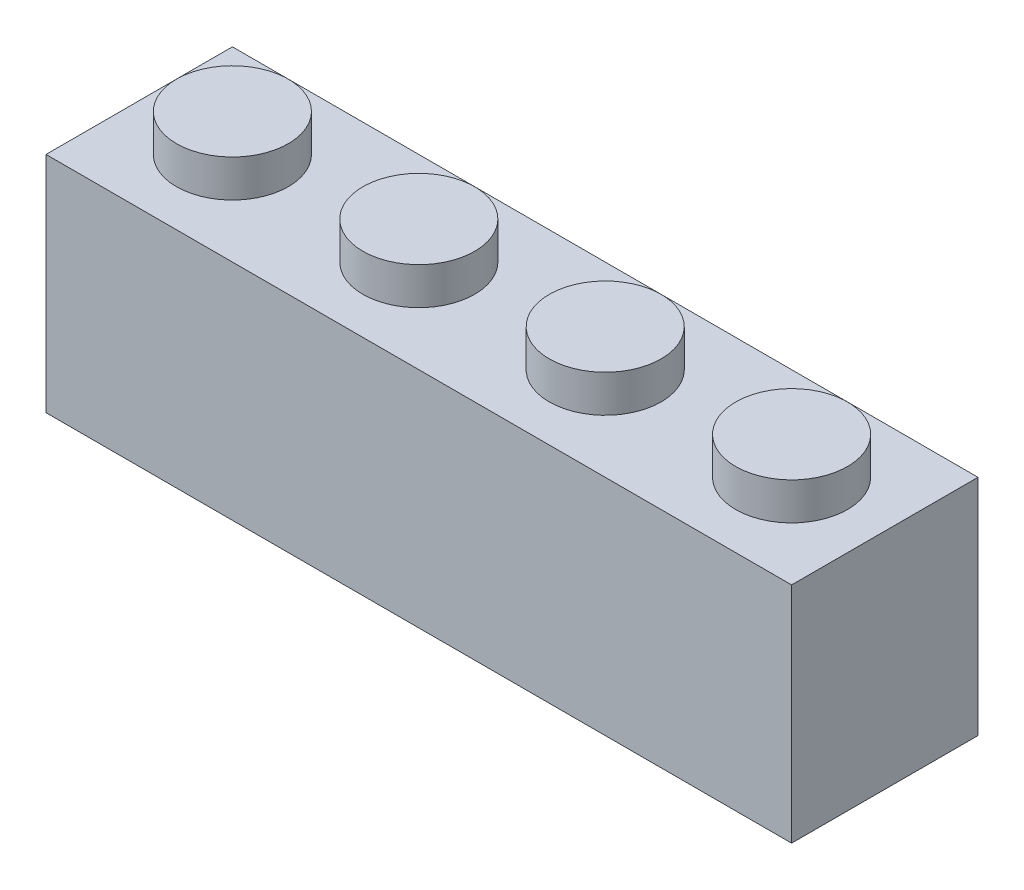
ISO-10303-21;
HEADER;
FILE_DESCRIPTION(('STEP AP214'),'2;1');
FILE_NAME('part.step','',(''),(''),'','','');
FILE_SCHEMA(('AUTOMOTIVE_DESIGN { 1 0 10303 214 1 1 1 1 }'));
ENDSEC;
DATA;
#1=APPLICATION_CONTEXT('core data for automotive mechanical design processes');
#2=APPLICATION_PROTOCOL_DEFINITION('international standard','automotive_design',2000,#1);
#3=PRODUCT_CONTEXT('',#1,'mechanical');
#4=PRODUCT('Part','Part','',(#3));
#5=PRODUCT_RELATED_PRODUCT_CATEGORY('part','',(#4));
#6=PRODUCT_DEFINITION_FORMATION('','',#4);
#7=PRODUCT_DEFINITION_CONTEXT('part definition',#1,'design');
#8=PRODUCT_DEFINITION('design','',#6,#7);
#9=PRODUCT_DEFINITION_SHAPE('','',#8);
#10=(LENGTH_UNIT() NAMED_UNIT(*) SI_UNIT(.MILLI.,.METRE.));
#11=(NAMED_UNIT(*) PLANE_ANGLE_UNIT() SI_UNIT($,.RADIAN.));
#12=(NAMED_UNIT(*) SI_UNIT($,.STERADIAN.) SOLID_ANGLE_UNIT());
#13=UNCERTAINTY_MEASURE_WITH_UNIT(LENGTH_MEASURE(1.E-05),#10,'distance_accuracy_value','');
#14=(GEOMETRIC_REPRESENTATION_CONTEXT(3) GLOBAL_UNCERTAINTY_ASSIGNED_CONTEXT((#13)) GLOBAL_UNIT_ASSIGNED_CONTEXT((#10,
#11,#12)) REPRESENTATION_CONTEXT('',''));
#15=CARTESIAN_POINT('',(0.,0.,0.));
#16=DIRECTION('',(0.,0.,1.));
#17=DIRECTION('',(1.,0.,0.));
#18=AXIS2_PLACEMENT_3D('',#15,#16,#17);
#19=CARTESIAN_POINT('',(-7.5,2.,0.));
#20=DIRECTION('',(0.,-1.,0.));
#21=DIRECTION('',(0.,0.,-1.));
#22=AXIS2_PLACEMENT_3D('',#19,#20,#21);
#23=CYLINDRICAL_SURFACE('',#22,1.5);
#24=CARTESIAN_POINT('',(-7.5,1.,0.));
#25=DIRECTION('',(0.,1.,0.));
#26=DIRECTION('',(0.,0.,1.));
#27=AXIS2_PLACEMENT_3D('',#24,#25,#26);
#28=CIRCLE('',#27,1.5);
#29=CARTESIAN_POINT('',(-7.5,1.,1.5));
#30=VERTEX_POINT('',#29);
#31=EDGE_CURVE('E83',#30,#30,#28,.T.);
#32=ORIENTED_EDGE('',*,*,#31,.T.);
#33=EDGE_LOOP('',(#32));
#34=FACE_BOUND('',#33,.T.);
#35=CARTESIAN_POINT('',(-7.5,2.,0.));
#36=DIRECTION('',(0.,1.,0.));
#37=DIRECTION('',(0.,0.,1.));
#38=AXIS2_PLACEMENT_3D('',#35,#36,#37);
#39=CIRCLE('',#38,1.5);
#40=CARTESIAN_POINT('',(-7.5,2.,1.5));
#41=VERTEX_POINT('',#40);
#42=EDGE_CURVE('E12',#41,#41,#39,.T.);
#43=ORIENTED_EDGE('',*,*,#42,.F.);
#44=EDGE_LOOP('',(#43));
#45=FACE_BOUND('',#44,.T.);
#46=ADVANCED_FACE('F80',(#34,#45),#23,.T.);
#47=CARTESIAN_POINT('',(0.,2.,0.));
#48=DIRECTION('',(0.,1.,0.));
#49=DIRECTION('',(0.,0.,1.));
#50=AXIS2_PLACEMENT_3D('',#47,#48,#49);
#51=PLANE('',#50);
#52=ORIENTED_EDGE('',*,*,#42,.T.);
#53=EDGE_LOOP('',(#52));
#54=FACE_BOUND('',#53,.T.);
#55=ADVANCED_FACE('F293',(#54),#51,.T.);
#56=CARTESIAN_POINT('',(-10.,1.,2.5));
#57=DIRECTION('',(0.,0.,-1.));
#58=DIRECTION('',(-1.,0.,0.));
#59=AXIS2_PLACEMENT_3D('',#56,#57,#58);
#60=PLANE('',#59);
#61=DIRECTION('',(0.,-1.,0.));
#62=VECTOR('',#61,1.);
#63=CARTESIAN_POINT('',(-10.,1.,2.5));
#64=LINE('',#63,#62);
#65=CARTESIAN_POINT('',(-10.,1.,2.5));
#66=VERTEX_POINT('',#65);
#67=CARTESIAN_POINT('',(-10.,-5.,2.5));
#68=VERTEX_POINT('',#67);
#69=EDGE_CURVE('E251',#66,#68,#64,.T.);
#70=ORIENTED_EDGE('',*,*,#69,.T.);
#71=DIRECTION('',(1.,0.,0.));
#72=VECTOR('',#71,1.);
#73=CARTESIAN_POINT('',(0.,-5.,2.5));
#74=LINE('',#73,#72);
#75=CARTESIAN_POINT('',(10.,-5.,2.5));
#76=VERTEX_POINT('',#75);
#77=EDGE_CURVE('E178',#68,#76,#74,.T.);
#78=ORIENTED_EDGE('',*,*,#77,.T.);
#79=DIRECTION('',(0.,-1.,0.));
#80=VECTOR('',#79,1.);
#81=CARTESIAN_POINT('',(10.,1.,2.5));
#82=LINE('',#81,#80);
#83=CARTESIAN_POINT('',(10.,1.,2.5));
#84=VERTEX_POINT('',#83);
#85=EDGE_CURVE('E257',#84,#76,#82,.T.);
#86=ORIENTED_EDGE('',*,*,#85,.F.);
#87=DIRECTION('',(1.,0.,0.));
#88=VECTOR('',#87,1.);
#89=CARTESIAN_POINT('',(-10.,1.,2.5));
#90=LINE('',#89,#88);
#91=EDGE_CURVE('E240',#66,#84,#90,.T.);
#92=ORIENTED_EDGE('',*,*,#91,.F.);
#93=EDGE_LOOP('',(#70,#78,#86,#92));
#94=FACE_BOUND('',#93,.T.);
#95=ADVANCED_FACE('F278',(#94),#60,.F.);
#96=CARTESIAN_POINT('',(10.,1.,2.5));
#97=DIRECTION('',(-1.,0.,0.));
#98=DIRECTION('',(0.,0.,1.));
#99=AXIS2_PLACEMENT_3D('',#96,#97,#98);
#100=PLANE('',#99);
#101=ORIENTED_EDGE('',*,*,#85,.T.);
#102=DIRECTION('',(0.,0.,-1.));
#103=VECTOR('',#102,1.);
#104=CARTESIAN_POINT('',(10.,-5.,0.));
#105=LINE('',#104,#103);
#106=CARTESIAN_POINT('',(10.,-5.,-2.5));
#107=VERTEX_POINT('',#106);
#108=EDGE_CURVE('E181',#76,#107,#105,.T.);
#109=ORIENTED_EDGE('',*,*,#108,.T.);
#110=DIRECTION('',(0.,-1.,0.));
#111=VECTOR('',#110,1.);
#112=CARTESIAN_POINT('',(10.,1.,-2.5));
#113=LINE('',#112,#111);
#114=CARTESIAN_POINT('',(10.,1.,-2.5));
#115=VERTEX_POINT('',#114);
#116=EDGE_CURVE('E255',#115,#107,#113,.T.);
#117=ORIENTED_EDGE('',*,*,#116,.F.);
#118=DIRECTION('',(0.,0.,-1.));
#119=VECTOR('',#118,1.);
#120=CARTESIAN_POINT('',(10.,1.,2.5));
#121=LINE('',#120,#119);
#122=EDGE_CURVE('E243',#84,#115,#121,.T.);
#123=ORIENTED_EDGE('',*,*,#122,.F.);
#124=EDGE_LOOP('',(#101,#109,#117,#123));
#125=FACE_BOUND('',#124,.T.);
#126=ADVANCED_FACE('F282',(#125),#100,.F.);
#127=CARTESIAN_POINT('',(-10.,1.,-2.5));
#128=DIRECTION('',(0.,0.,-1.));
#129=DIRECTION('',(-1.,0.,0.));
#130=AXIS2_PLACEMENT_3D('',#127,#128,#129);
#131=PLANE('',#130);
#132=ORIENTED_EDGE('',*,*,#116,.T.);
#133=DIRECTION('',(1.,0.,0.));
#134=VECTOR('',#133,1.);
#135=CARTESIAN_POINT('',(0.,-5.,-2.5));
#136=LINE('',#135,#134);
#137=CARTESIAN_POINT('',(-10.,-5.,-2.5));
#138=VERTEX_POINT('',#137);
#139=EDGE_CURVE('E184',#138,#107,#136,.T.);
#140=ORIENTED_EDGE('',*,*,#139,.F.);
#141=DIRECTION('',(0.,-1.,0.));
#142=VECTOR('',#141,1.);
#143=CARTESIAN_POINT('',(-10.,1.,-2.5));
#144=LINE('',#143,#142);
#145=CARTESIAN_POINT('',(-10.,1.,-2.5));
#146=VERTEX_POINT('',#145);
#147=EDGE_CURVE('E253',#146,#138,#144,.T.);
#148=ORIENTED_EDGE('',*,*,#147,.F.);
#149=DIRECTION('',(1.,0.,0.));
#150=VECTOR('',#149,1.);
#151=CARTESIAN_POINT('',(-10.,1.,-2.5));
#152=LINE('',#151,#150);
#153=EDGE_CURVE('E245',#146,#115,#152,.T.);
#154=ORIENTED_EDGE('',*,*,#153,.T.);
#155=EDGE_LOOP('',(#132,#140,#148,#154));
#156=FACE_BOUND('',#155,.T.);
#157=ADVANCED_FACE('F284',(#156),#131,.T.);
#158=CARTESIAN_POINT('',(-10.,1.,2.5));
#159=DIRECTION('',(-1.,0.,0.));
#160=DIRECTION('',(0.,0.,1.));
#161=AXIS2_PLACEMENT_3D('',#158,#159,#160);
#162=PLANE('',#161);
#163=ORIENTED_EDGE('',*,*,#147,.T.);
#164=DIRECTION('',(0.,0.,-1.));
#165=VECTOR('',#164,1.);
#166=CARTESIAN_POINT('',(-10.,-5.,0.));
#167=LINE('',#166,#165);
#168=EDGE_CURVE('E164',#68,#138,#167,.T.);
#169=ORIENTED_EDGE('',*,*,#168,.F.);
#170=ORIENTED_EDGE('',*,*,#69,.F.);
#171=DIRECTION('',(0.,0.,-1.));
#172=VECTOR('',#171,1.);
#173=CARTESIAN_POINT('',(-10.,1.,2.5));
#174=LINE('',#173,#172);
#175=EDGE_CURVE('E248',#66,#146,#174,.T.);
#176=ORIENTED_EDGE('',*,*,#175,.T.);
#177=EDGE_LOOP('',(#163,#169,#170,#176));
#178=FACE_BOUND('',#177,.T.);
#179=ADVANCED_FACE('F270',(#178),#162,.T.);
#180=CARTESIAN_POINT('',(0.,1.,0.));
#181=DIRECTION('',(0.,1.,0.));
#182=DIRECTION('',(0.,0.,1.));
#183=AXIS2_PLACEMENT_3D('',#180,#181,#182);
#184=PLANE('',#183);
#185=CARTESIAN_POINT('',(7.5,1.,0.));
#186=DIRECTION('',(0.,1.,0.));
#187=DIRECTION('',(0.,0.,1.));
#188=AXIS2_PLACEMENT_3D('',#185,#186,#187);
#189=CIRCLE('',#188,1.5);
#190=CARTESIAN_POINT('',(7.5,1.,1.5));
#191=VERTEX_POINT('',#190);
#192=EDGE_CURVE('E225',#191,#191,#189,.F.);
#193=ORIENTED_EDGE('',*,*,#192,.T.);
#194=EDGE_LOOP('',(#193));
#195=FACE_BOUND('',#194,.T.);
#196=CARTESIAN_POINT('',(2.5,1.,0.));
#197=DIRECTION('',(0.,1.,0.));
#198=DIRECTION('',(0.,0.,1.));
#199=AXIS2_PLACEMENT_3D('',#196,#197,#198);
#200=CIRCLE('',#199,1.5);
#201=CARTESIAN_POINT('',(2.5,1.,1.5));
#202=VERTEX_POINT('',#201);
#203=EDGE_CURVE('E231',#202,#202,#200,.F.);
#204=ORIENTED_EDGE('',*,*,#203,.T.);
#205=EDGE_LOOP('',(#204));
#206=FACE_BOUND('',#205,.T.);
#207=CARTESIAN_POINT('',(-2.5,1.,0.));
#208=DIRECTION('',(0.,1.,0.));
#209=DIRECTION('',(0.,0.,1.));
#210=AXIS2_PLACEMENT_3D('',#207,#208,#209);
#211=CIRCLE('',#210,1.5);
#212=CARTESIAN_POINT('',(-2.5,1.,1.5));
#213=VERTEX_POINT('',#212);
#214=EDGE_CURVE('E237',#213,#213,#211,.F.);
#215=ORIENTED_EDGE('',*,*,#214,.T.);
#216=EDGE_LOOP('',(#215));
#217=FACE_BOUND('',#216,.T.);
#218=ORIENTED_EDGE('',*,*,#31,.F.);
#219=EDGE_LOOP('',(#218));
#220=FACE_BOUND('',#219,.T.);
#221=ORIENTED_EDGE('',*,*,#91,.T.);
#222=ORIENTED_EDGE('',*,*,#122,.T.);
#223=ORIENTED_EDGE('',*,*,#153,.F.);
#224=ORIENTED_EDGE('',*,*,#175,.F.);
#225=EDGE_LOOP('',(#221,#222,#223,#224));
#226=FACE_BOUND('',#225,.T.);
#227=ADVANCED_FACE('F266',(#195,#206,#217,#220,#226),#184,.T.);
#228=CARTESIAN_POINT('',(-2.5,2.,0.));
#229=DIRECTION('',(0.,-1.,0.));
#230=DIRECTION('',(0.,0.,-1.));
#231=AXIS2_PLACEMENT_3D('',#228,#229,#230);
#232=CYLINDRICAL_SURFACE('',#231,1.5);
#233=ORIENTED_EDGE('',*,*,#214,.F.);
#234=EDGE_LOOP('',(#233));
#235=FACE_BOUND('',#234,.T.);
#236=CARTESIAN_POINT('',(-2.5,2.,0.));
#237=DIRECTION('',(0.,1.,0.));
#238=DIRECTION('',(0.,0.,1.));
#239=AXIS2_PLACEMENT_3D('',#236,#237,#238);
#240=CIRCLE('',#239,1.5);
#241=CARTESIAN_POINT('',(-2.5,2.,1.5));
#242=VERTEX_POINT('',#241);
#243=EDGE_CURVE('E234',#242,#242,#240,.T.);
#244=ORIENTED_EDGE('',*,*,#243,.F.);
#245=EDGE_LOOP('',(#244));
#246=FACE_BOUND('',#245,.T.);
#247=ADVANCED_FACE('F269',(#235,#246),#232,.T.);
#248=CARTESIAN_POINT('',(0.,2.,0.));
#249=DIRECTION('',(0.,1.,0.));
#250=DIRECTION('',(0.,0.,1.));
#251=AXIS2_PLACEMENT_3D('',#248,#249,#250);
#252=PLANE('',#251);
#253=ORIENTED_EDGE('',*,*,#243,.T.);
#254=EDGE_LOOP('',(#253));
#255=FACE_BOUND('',#254,.T.);
#256=ADVANCED_FACE('F395',(#255),#252,.T.);
#257=CARTESIAN_POINT('',(2.5,2.,0.));
#258=DIRECTION('',(0.,-1.,0.));
#259=DIRECTION('',(0.,0.,-1.));
#260=AXIS2_PLACEMENT_3D('',#257,#258,#259);
#261=CYLINDRICAL_SURFACE('',#260,1.5);
#262=ORIENTED_EDGE('',*,*,#203,.F.);
#263=EDGE_LOOP('',(#262));
#264=FACE_BOUND('',#263,.T.);
#265=CARTESIAN_POINT('',(2.5,2.,0.));
#266=DIRECTION('',(0.,1.,0.));
#267=DIRECTION('',(0.,0.,1.));
#268=AXIS2_PLACEMENT_3D('',#265,#266,#267);
#269=CIRCLE('',#268,1.5);
#270=CARTESIAN_POINT('',(2.5,2.,1.5));
#271=VERTEX_POINT('',#270);
#272=EDGE_CURVE('E228',#271,#271,#269,.T.);
#273=ORIENTED_EDGE('',*,*,#272,.F.);
#274=EDGE_LOOP('',(#273));
#275=FACE_BOUND('',#274,.T.);
#276=ADVANCED_FACE('F391',(#264,#275),#261,.T.);
#277=CARTESIAN_POINT('',(0.,2.,0.));
#278=DIRECTION('',(0.,1.,0.));
#279=DIRECTION('',(0.,0.,1.));
#280=AXIS2_PLACEMENT_3D('',#277,#278,#279);
#281=PLANE('',#280);
#282=ORIENTED_EDGE('',*,*,#272,.T.);
#283=EDGE_LOOP('',(#282));
#284=FACE_BOUND('',#283,.T.);
#285=ADVANCED_FACE('F387',(#284),#281,.T.);
#286=CARTESIAN_POINT('',(7.5,2.,0.));
#287=DIRECTION('',(0.,-1.,0.));
#288=DIRECTION('',(0.,0.,-1.));
#289=AXIS2_PLACEMENT_3D('',#286,#287,#288);
#290=CYLINDRICAL_SURFACE('',#289,1.5);
#291=ORIENTED_EDGE('',*,*,#192,.F.);
#292=EDGE_LOOP('',(#291));
#293=FACE_BOUND('',#292,.T.);
#294=CARTESIAN_POINT('',(7.5,2.,0.));
#295=DIRECTION('',(0.,1.,0.));
#296=DIRECTION('',(0.,0.,1.));
#297=AXIS2_PLACEMENT_3D('',#294,#295,#296);
#298=CIRCLE('',#297,1.5);
#299=CARTESIAN_POINT('',(7.5,2.,1.5));
#300=VERTEX_POINT('',#299);
#301=EDGE_CURVE('E220',#300,#300,#298,.T.);
#302=ORIENTED_EDGE('',*,*,#301,.F.);
#303=EDGE_LOOP('',(#302));
#304=FACE_BOUND('',#303,.T.);
#305=ADVANCED_FACE('F383',(#293,#304),#290,.T.);
#306=CARTESIAN_POINT('',(0.,2.,0.));
#307=DIRECTION('',(0.,1.,0.));
#308=DIRECTION('',(0.,0.,1.));
#309=AXIS2_PLACEMENT_3D('',#306,#307,#308);
#310=PLANE('',#309);
#311=ORIENTED_EDGE('',*,*,#301,.T.);
#312=EDGE_LOOP('',(#311));
#313=FACE_BOUND('',#312,.T.);
#314=ADVANCED_FACE('F348',(#313),#310,.T.);
#315=CARTESIAN_POINT('',(9.,-5.,0.));
#316=DIRECTION('',(1.,0.,0.));
#317=DIRECTION('',(0.,0.,-1.));
#318=AXIS2_PLACEMENT_3D('',#315,#316,#317);
#319=PLANE('',#318);
#320=DIRECTION('',(0.,0.,-1.));
#321=VECTOR('',#320,1.);
#322=CARTESIAN_POINT('',(9.,0.,0.));
#323=LINE('',#322,#321);
#324=CARTESIAN_POINT('',(9.,0.,1.5));
#325=VERTEX_POINT('',#324);
#326=CARTESIAN_POINT('',(9.,0.,-1.5));
#327=VERTEX_POINT('',#326);
#328=EDGE_CURVE('E189',#325,#327,#323,.T.);
#329=ORIENTED_EDGE('',*,*,#328,.T.);
#330=DIRECTION('',(0.,1.,0.));
#331=VECTOR('',#330,1.);
#332=CARTESIAN_POINT('',(9.,-5.,-1.5));
#333=LINE('',#332,#331);
#334=CARTESIAN_POINT('',(9.,-5.,-1.5));
#335=VERTEX_POINT('',#334);
#336=EDGE_CURVE('E167',#335,#327,#333,.T.);
#337=ORIENTED_EDGE('',*,*,#336,.F.);
#338=DIRECTION('',(0.,0.,-1.));
#339=VECTOR('',#338,1.);
#340=CARTESIAN_POINT('',(9.,-5.,0.));
#341=LINE('',#340,#339);
#342=CARTESIAN_POINT('',(9.,-5.,1.5));
#343=VERTEX_POINT('',#342);
#344=EDGE_CURVE('E149',#343,#335,#341,.T.);
#345=ORIENTED_EDGE('',*,*,#344,.F.);
#346=DIRECTION('',(0.,1.,0.));
#347=VECTOR('',#346,1.);
#348=CARTESIAN_POINT('',(9.,-5.,1.5));
#349=LINE('',#348,#347);
#350=EDGE_CURVE('E158',#343,#325,#349,.T.);
#351=ORIENTED_EDGE('',*,*,#350,.T.);
#352=EDGE_LOOP('',(#329,#337,#345,#351));
#353=FACE_BOUND('',#352,.T.);
#354=ADVANCED_FACE('F166',(#353),#319,.F.);
#355=CARTESIAN_POINT('',(0.,-5.,-1.5));
#356=DIRECTION('',(0.,0.,1.));
#357=DIRECTION('',(1.,0.,0.));
#358=AXIS2_PLACEMENT_3D('',#355,#356,#357);
#359=PLANE('',#358);
#360=DIRECTION('',(1.,0.,0.));
#361=VECTOR('',#360,1.);
#362=CARTESIAN_POINT('',(0.,0.,-1.5));
#363=LINE('',#362,#361);
#364=CARTESIAN_POINT('',(-9.,0.,-1.5));
#365=VERTEX_POINT('',#364);
#366=EDGE_CURVE('E94',#365,#327,#363,.T.);
#367=ORIENTED_EDGE('',*,*,#366,.F.);
#368=DIRECTION('',(0.,1.,0.));
#369=VECTOR('',#368,1.);
#370=CARTESIAN_POINT('',(-9.,-5.,-1.5));
#371=LINE('',#370,#369);
#372=CARTESIAN_POINT('',(-9.,-5.,-1.5));
#373=VERTEX_POINT('',#372);
#374=EDGE_CURVE('E196',#373,#365,#371,.T.);
#375=ORIENTED_EDGE('',*,*,#374,.F.);
#376=DIRECTION('',(1.,0.,0.));
#377=VECTOR('',#376,1.);
#378=CARTESIAN_POINT('',(0.,-5.,-1.5));
#379=LINE('',#378,#377);
#380=EDGE_CURVE('E176',#373,#335,#379,.T.);
#381=ORIENTED_EDGE('',*,*,#380,.T.);
#382=ORIENTED_EDGE('',*,*,#336,.T.);
#383=EDGE_LOOP('',(#367,#375,#381,#382));
#384=FACE_BOUND('',#383,.T.);
#385=ADVANCED_FACE('F340',(#384),#359,.T.);
#386=CARTESIAN_POINT('',(-9.,-5.,0.));
#387=DIRECTION('',(1.,0.,0.));
#388=DIRECTION('',(0.,0.,-1.));
#389=AXIS2_PLACEMENT_3D('',#386,#387,#388);
#390=PLANE('',#389);
#391=DIRECTION('',(0.,0.,-1.));
#392=VECTOR('',#391,1.);
#393=CARTESIAN_POINT('',(-9.,0.,0.));
#394=LINE('',#393,#392);
#395=CARTESIAN_POINT('',(-9.,0.,1.5));
#396=VERTEX_POINT('',#395);
#397=EDGE_CURVE('E99',#396,#365,#394,.T.);
#398=ORIENTED_EDGE('',*,*,#397,.F.);
#399=DIRECTION('',(0.,1.,0.));
#400=VECTOR('',#399,1.);
#401=CARTESIAN_POINT('',(-9.,-5.,1.5));
#402=LINE('',#401,#400);
#403=CARTESIAN_POINT('',(-9.,-5.,1.5));
#404=VERTEX_POINT('',#403);
#405=EDGE_CURVE('E163',#404,#396,#402,.T.);
#406=ORIENTED_EDGE('',*,*,#405,.F.);
#407=DIRECTION('',(0.,0.,-1.));
#408=VECTOR('',#407,1.);
#409=CARTESIAN_POINT('',(-9.,-5.,0.));
#410=LINE('',#409,#408);
#411=EDGE_CURVE('E152',#404,#373,#410,.T.);
#412=ORIENTED_EDGE('',*,*,#411,.T.);
#413=ORIENTED_EDGE('',*,*,#374,.T.);
#414=EDGE_LOOP('',(#398,#406,#412,#413));
#415=FACE_BOUND('',#414,.T.);
#416=ADVANCED_FACE('F338',(#415),#390,.T.);
#417=CARTESIAN_POINT('',(0.,-5.,1.5));
#418=DIRECTION('',(0.,0.,1.));
#419=DIRECTION('',(1.,0.,0.));
#420=AXIS2_PLACEMENT_3D('',#417,#418,#419);
#421=PLANE('',#420);
#422=DIRECTION('',(1.,0.,0.));
#423=VECTOR('',#422,1.);
#424=CARTESIAN_POINT('',(0.,0.,1.5));
#425=LINE('',#424,#423);
#426=EDGE_CURVE('E160',#396,#325,#425,.T.);
#427=ORIENTED_EDGE('',*,*,#426,.T.);
#428=ORIENTED_EDGE('',*,*,#350,.F.);
#429=DIRECTION('',(1.,0.,0.));
#430=VECTOR('',#429,1.);
#431=CARTESIAN_POINT('',(0.,-5.,1.5));
#432=LINE('',#431,#430);
#433=EDGE_CURVE('E143',#404,#343,#432,.T.);
#434=ORIENTED_EDGE('',*,*,#433,.F.);
#435=ORIENTED_EDGE('',*,*,#405,.T.);
#436=EDGE_LOOP('',(#427,#428,#434,#435));
#437=FACE_BOUND('',#436,.T.);
#438=ADVANCED_FACE('F159',(#437),#421,.F.);
#439=CARTESIAN_POINT('',(0.,-5.,0.));
#440=DIRECTION('',(0.,1.,0.));
#441=DIRECTION('',(0.,0.,1.));
#442=AXIS2_PLACEMENT_3D('',#439,#440,#441);
#443=PLANE('',#442);
#444=ORIENTED_EDGE('',*,*,#344,.T.);
#445=ORIENTED_EDGE('',*,*,#380,.F.);
#446=ORIENTED_EDGE('',*,*,#411,.F.);
#447=ORIENTED_EDGE('',*,*,#433,.T.);
#448=EDGE_LOOP('',(#444,#445,#446,#447));
#449=FACE_BOUND('',#448,.T.);
#450=ORIENTED_EDGE('',*,*,#77,.F.);
#451=ORIENTED_EDGE('',*,*,#168,.T.);
#452=ORIENTED_EDGE('',*,*,#139,.T.);
#453=ORIENTED_EDGE('',*,*,#108,.F.);
#454=EDGE_LOOP('',(#450,#451,#452,#453));
#455=FACE_BOUND('',#454,.T.);
#456=ADVANCED_FACE('F145',(#449,#455),#443,.F.);
#457=CARTESIAN_POINT('',(0.,1.,0.));
#458=DIRECTION('',(0.,1.,0.));
#459=DIRECTION('',(0.,0.,1.));
#460=AXIS2_PLACEMENT_3D('',#457,#458,#459);
#461=PLANE('',#460);
#462=CARTESIAN_POINT('',(-2.5,1.,0.));
#463=DIRECTION('',(0.,1.,0.));
#464=DIRECTION('',(0.,0.,1.));
#465=AXIS2_PLACEMENT_3D('',#462,#463,#464);
#466=CIRCLE('',#465,0.75);
#467=CARTESIAN_POINT('',(-2.5,1.,0.75));
#468=VERTEX_POINT('',#467);
#469=EDGE_CURVE('E199',#468,#468,#466,.T.);
#470=ORIENTED_EDGE('',*,*,#469,.F.);
#471=EDGE_LOOP('',(#470));
#472=FACE_BOUND('',#471,.T.);
#473=ADVANCED_FACE('F354',(#472),#461,.F.);
#474=CARTESIAN_POINT('',(0.,1.,0.));
#475=DIRECTION('',(0.,1.,0.));
#476=DIRECTION('',(0.,0.,1.));
#477=AXIS2_PLACEMENT_3D('',#474,#475,#476);
#478=PLANE('',#477);
#479=CARTESIAN_POINT('',(2.5,1.,0.));
#480=DIRECTION('',(0.,1.,0.));
#481=DIRECTION('',(0.,0.,1.));
#482=AXIS2_PLACEMENT_3D('',#479,#480,#481);
#483=CIRCLE('',#482,0.75);
#484=CARTESIAN_POINT('',(2.5,1.,0.75));
#485=VERTEX_POINT('',#484);
#486=EDGE_CURVE('E206',#485,#485,#483,.T.);
#487=ORIENTED_EDGE('',*,*,#486,.F.);
#488=EDGE_LOOP('',(#487));
#489=FACE_BOUND('',#488,.T.);
#490=ADVANCED_FACE('F357',(#489),#478,.F.);
#491=CARTESIAN_POINT('',(0.,1.,0.));
#492=DIRECTION('',(0.,1.,0.));
#493=DIRECTION('',(0.,0.,1.));
#494=AXIS2_PLACEMENT_3D('',#491,#492,#493);
#495=PLANE('',#494);
#496=CARTESIAN_POINT('',(7.5,1.,0.));
#497=DIRECTION('',(0.,1.,0.));
#498=DIRECTION('',(0.,0.,1.));
#499=AXIS2_PLACEMENT_3D('',#496,#497,#498);
#500=CIRCLE('',#499,0.75);
#501=CARTESIAN_POINT('',(7.5,1.,0.75));
#502=VERTEX_POINT('',#501);
#503=EDGE_CURVE('E212',#502,#502,#500,.T.);
#504=ORIENTED_EDGE('',*,*,#503,.F.);
#505=EDGE_LOOP('',(#504));
#506=FACE_BOUND('',#505,.T.);
#507=ADVANCED_FACE('F367',(#506),#495,.F.);
#508=CARTESIAN_POINT('',(0.,1.,0.));
#509=DIRECTION('',(0.,1.,0.));
#510=DIRECTION('',(0.,0.,1.));
#511=AXIS2_PLACEMENT_3D('',#508,#509,#510);
#512=PLANE('',#511);
#513=CARTESIAN_POINT('',(-7.5,1.,0.));
#514=DIRECTION('',(0.,1.,0.));
#515=DIRECTION('',(0.,0.,1.));
#516=AXIS2_PLACEMENT_3D('',#513,#514,#515);
#517=CIRCLE('',#516,0.75);
#518=CARTESIAN_POINT('',(-7.5,1.,0.75));
#519=VERTEX_POINT('',#518);
#520=EDGE_CURVE('E217',#519,#519,#517,.T.);
#521=ORIENTED_EDGE('',*,*,#520,.F.);
#522=EDGE_LOOP('',(#521));
#523=FACE_BOUND('',#522,.T.);
#524=ADVANCED_FACE('F363',(#523),#512,.F.);
#525=CARTESIAN_POINT('',(-2.5,1.,0.));
#526=DIRECTION('',(0.,-1.,0.));
#527=DIRECTION('',(0.,0.,-1.));
#528=AXIS2_PLACEMENT_3D('',#525,#526,#527);
#529=CYLINDRICAL_SURFACE('',#528,0.75);
#530=ORIENTED_EDGE('',*,*,#469,.T.);
#531=EDGE_LOOP('',(#530));
#532=FACE_BOUND('',#531,.T.);
#533=CARTESIAN_POINT('',(-2.5,0.,0.));
#534=DIRECTION('',(0.,1.,0.));
#535=DIRECTION('',(0.,0.,1.));
#536=AXIS2_PLACEMENT_3D('',#533,#534,#535);
#537=CIRCLE('',#536,0.75);
#538=CARTESIAN_POINT('',(-2.5,0.,0.75));
#539=VERTEX_POINT('',#538);
#540=EDGE_CURVE('E203',#539,#539,#537,.T.);
#541=ORIENTED_EDGE('',*,*,#540,.F.);
#542=EDGE_LOOP('',(#541));
#543=FACE_BOUND('',#542,.T.);
#544=ADVANCED_FACE('F359',(#532,#543),#529,.F.);
#545=CARTESIAN_POINT('',(2.5,1.,0.));
#546=DIRECTION('',(0.,-1.,0.));
#547=DIRECTION('',(0.,0.,-1.));
#548=AXIS2_PLACEMENT_3D('',#545,#546,#547);
#549=CYLINDRICAL_SURFACE('',#548,0.75);
#550=ORIENTED_EDGE('',*,*,#486,.T.);
#551=EDGE_LOOP('',(#550));
#552=FACE_BOUND('',#551,.T.);
#553=CARTESIAN_POINT('',(2.5,0.,0.));
#554=DIRECTION('',(0.,1.,0.));
#555=DIRECTION('',(0.,0.,1.));
#556=AXIS2_PLACEMENT_3D('',#553,#554,#555);
#557=CIRCLE('',#556,0.75);
#558=CARTESIAN_POINT('',(2.5,0.,0.75));
#559=VERTEX_POINT('',#558);
#560=EDGE_CURVE('E209',#559,#559,#557,.T.);
#561=ORIENTED_EDGE('',*,*,#560,.F.);
#562=EDGE_LOOP('',(#561));
#563=FACE_BOUND('',#562,.T.);
#564=ADVANCED_FACE('F362',(#552,#563),#549,.F.);
#565=CARTESIAN_POINT('',(7.5,1.,0.));
#566=DIRECTION('',(0.,-1.,0.));
#567=DIRECTION('',(0.,0.,-1.));
#568=AXIS2_PLACEMENT_3D('',#565,#566,#567);
#569=CYLINDRICAL_SURFACE('',#568,0.75);
#570=ORIENTED_EDGE('',*,*,#503,.T.);
#571=EDGE_LOOP('',(#570));
#572=FACE_BOUND('',#571,.T.);
#573=CARTESIAN_POINT('',(7.5,0.,0.));
#574=DIRECTION('',(0.,1.,0.));
#575=DIRECTION('',(0.,0.,1.));
#576=AXIS2_PLACEMENT_3D('',#573,#574,#575);
#577=CIRCLE('',#576,0.75);
#578=CARTESIAN_POINT('',(7.5,0.,0.75));
#579=VERTEX_POINT('',#578);
#580=EDGE_CURVE('E195',#579,#579,#577,.T.);
#581=ORIENTED_EDGE('',*,*,#580,.F.);
#582=EDGE_LOOP('',(#581));
#583=FACE_BOUND('',#582,.T.);
#584=ADVANCED_FACE('F316',(#572,#583),#569,.F.);
#585=CARTESIAN_POINT('',(-7.5,1.,0.));
#586=DIRECTION('',(0.,-1.,0.));
#587=DIRECTION('',(0.,0.,-1.));
#588=AXIS2_PLACEMENT_3D('',#585,#586,#587);
#589=CYLINDRICAL_SURFACE('',#588,0.75);
#590=ORIENTED_EDGE('',*,*,#520,.T.);
#591=EDGE_LOOP('',(#590));
#592=FACE_BOUND('',#591,.T.);
#593=CARTESIAN_POINT('',(-7.5,0.,0.));
#594=DIRECTION('',(0.,1.,0.));
#595=DIRECTION('',(0.,0.,1.));
#596=AXIS2_PLACEMENT_3D('',#593,#594,#595);
#597=CIRCLE('',#596,0.75);
#598=CARTESIAN_POINT('',(-7.5,0.,0.75));
#599=VERTEX_POINT('',#598);
#600=EDGE_CURVE('E202',#599,#599,#597,.T.);
#601=ORIENTED_EDGE('',*,*,#600,.F.);
#602=EDGE_LOOP('',(#601));
#603=FACE_BOUND('',#602,.T.);
#604=ADVANCED_FACE('F307',(#592,#603),#589,.F.);
#605=CARTESIAN_POINT('',(0.,0.,0.));
#606=DIRECTION('',(0.,1.,0.));
#607=DIRECTION('',(0.,0.,1.));
#608=AXIS2_PLACEMENT_3D('',#605,#606,#607);
#609=PLANE('',#608);
#610=CARTESIAN_POINT('',(5.,0.,0.));
#611=DIRECTION('',(0.,1.,0.));
#612=DIRECTION('',(0.,0.,1.));
#613=AXIS2_PLACEMENT_3D('',#610,#611,#612);
#614=CIRCLE('',#613,1.);
#615=CARTESIAN_POINT('',(5.,0.,1.));
#616=VERTEX_POINT('',#615);
#617=EDGE_CURVE('E322',#616,#616,#614,.T.);
#618=ORIENTED_EDGE('',*,*,#617,.T.);
#619=EDGE_LOOP('',(#618));
#620=FACE_BOUND('',#619,.T.);
#621=CARTESIAN_POINT('',(0.,0.,0.));
#622=DIRECTION('',(0.,1.,0.));
#623=DIRECTION('',(0.,0.,1.));
#624=AXIS2_PLACEMENT_3D('',#621,#622,#623);
#625=CIRCLE('',#624,1.);
#626=CARTESIAN_POINT('',(0.,0.,1.));
#627=VERTEX_POINT('',#626);
#628=EDGE_CURVE('E326',#627,#627,#625,.T.);
#629=ORIENTED_EDGE('',*,*,#628,.T.);
#630=EDGE_LOOP('',(#629));
#631=FACE_BOUND('',#630,.T.);
#632=CARTESIAN_POINT('',(-5.,0.,0.));
#633=DIRECTION('',(0.,1.,0.));
#634=DIRECTION('',(0.,0.,1.));
#635=AXIS2_PLACEMENT_3D('',#632,#633,#634);
#636=CIRCLE('',#635,1.);
#637=CARTESIAN_POINT('',(-5.,0.,1.));
#638=VERTEX_POINT('',#637);
#639=EDGE_CURVE('E172',#638,#638,#636,.T.);
#640=ORIENTED_EDGE('',*,*,#639,.T.);
#641=EDGE_LOOP('',(#640));
#642=FACE_BOUND('',#641,.T.);
#643=ORIENTED_EDGE('',*,*,#600,.T.);
#644=EDGE_LOOP('',(#643));
#645=FACE_BOUND('',#644,.T.);
#646=ORIENTED_EDGE('',*,*,#580,.T.);
#647=EDGE_LOOP('',(#646));
#648=FACE_BOUND('',#647,.T.);
#649=ORIENTED_EDGE('',*,*,#560,.T.);
#650=EDGE_LOOP('',(#649));
#651=FACE_BOUND('',#650,.T.);
#652=ORIENTED_EDGE('',*,*,#540,.T.);
#653=EDGE_LOOP('',(#652));
#654=FACE_BOUND('',#653,.T.);
#655=ORIENTED_EDGE('',*,*,#328,.F.);
#656=ORIENTED_EDGE('',*,*,#426,.F.);
#657=ORIENTED_EDGE('',*,*,#397,.T.);
#658=ORIENTED_EDGE('',*,*,#366,.T.);
#659=EDGE_LOOP('',(#655,#656,#657,#658));
#660=FACE_BOUND('',#659,.T.);
#661=ADVANCED_FACE('F304',(#620,#631,#642,#645,#648,#651,#654,#660),#609,.F.);
#662=CARTESIAN_POINT('',(-5.,-5.,0.));
#663=DIRECTION('',(0.,1.,0.));
#664=DIRECTION('',(0.,0.,1.));
#665=AXIS2_PLACEMENT_3D('',#662,#663,#664);
#666=CYLINDRICAL_SURFACE('',#665,1.);
#667=CARTESIAN_POINT('',(-5.,-5.,0.));
#668=DIRECTION('',(0.,1.,0.));
#669=DIRECTION('',(0.,0.,1.));
#670=AXIS2_PLACEMENT_3D('',#667,#668,#669);
#671=CIRCLE('',#670,1.);
#672=CARTESIAN_POINT('',(-5.,-5.,1.));
#673=VERTEX_POINT('',#672);
#674=EDGE_CURVE('E191',#673,#673,#671,.T.);
#675=ORIENTED_EDGE('',*,*,#674,.T.);
#676=EDGE_LOOP('',(#675));
#677=FACE_BOUND('',#676,.T.);
#678=ORIENTED_EDGE('',*,*,#639,.F.);
#679=EDGE_LOOP('',(#678));
#680=FACE_BOUND('',#679,.T.);
#681=ADVANCED_FACE('F306',(#677,#680),#666,.T.);
#682=CARTESIAN_POINT('',(0.,-5.,0.));
#683=DIRECTION('',(0.,1.,0.));
#684=DIRECTION('',(0.,0.,1.));
#685=AXIS2_PLACEMENT_3D('',#682,#683,#684);
#686=PLANE('',#685);
#687=ORIENTED_EDGE('',*,*,#674,.F.);
#688=EDGE_LOOP('',(#687));
#689=FACE_BOUND('',#688,.T.);
#690=ADVANCED_FACE('F313',(#689),#686,.F.);
#691=CARTESIAN_POINT('',(0.,-5.,0.));
#692=DIRECTION('',(0.,1.,0.));
#693=DIRECTION('',(0.,0.,1.));
#694=AXIS2_PLACEMENT_3D('',#691,#692,#693);
#695=CYLINDRICAL_SURFACE('',#694,1.);
#696=CARTESIAN_POINT('',(0.,-5.,0.));
#697=DIRECTION('',(0.,1.,0.));
#698=DIRECTION('',(0.,0.,1.));
#699=AXIS2_PLACEMENT_3D('',#696,#697,#698);
#700=CIRCLE('',#699,1.);
#701=CARTESIAN_POINT('',(0.,-5.,1.));
#702=VERTEX_POINT('',#701);
#703=EDGE_CURVE('E531',#702,#702,#700,.T.);
#704=ORIENTED_EDGE('',*,*,#703,.T.);
#705=EDGE_LOOP('',(#704));
#706=FACE_BOUND('',#705,.T.);
#707=ORIENTED_EDGE('',*,*,#628,.F.);
#708=EDGE_LOOP('',(#707));
#709=FACE_BOUND('',#708,.T.);
#710=ADVANCED_FACE('F483',(#706,#709),#695,.T.);
#711=CARTESIAN_POINT('',(0.,-5.,0.));
#712=DIRECTION('',(0.,1.,0.));
#713=DIRECTION('',(0.,0.,1.));
#714=AXIS2_PLACEMENT_3D('',#711,#712,#713);
#715=PLANE('',#714);
#716=ORIENTED_EDGE('',*,*,#703,.F.);
#717=EDGE_LOOP('',(#716));
#718=FACE_BOUND('',#717,.T.);
#719=ADVANCED_FACE('F493',(#718),#715,.F.);
#720=CARTESIAN_POINT('',(5.,-5.,0.));
#721=DIRECTION('',(0.,1.,0.));
#722=DIRECTION('',(0.,0.,1.));
#723=AXIS2_PLACEMENT_3D('',#720,#721,#722);
#724=CYLINDRICAL_SURFACE('',#723,1.);
#725=CARTESIAN_POINT('',(5.,-5.,0.));
#726=DIRECTION('',(0.,1.,0.));
#727=DIRECTION('',(0.,0.,1.));
#728=AXIS2_PLACEMENT_3D('',#725,#726,#727);
#729=CIRCLE('',#728,1.);
#730=CARTESIAN_POINT('',(5.,-5.,1.));
#731=VERTEX_POINT('',#730);
#732=EDGE_CURVE('E529',#731,#731,#729,.T.);
#733=ORIENTED_EDGE('',*,*,#732,.T.);
#734=EDGE_LOOP('',(#733));
#735=FACE_BOUND('',#734,.T.);
#736=ORIENTED_EDGE('',*,*,#617,.F.);
#737=EDGE_LOOP('',(#736));
#738=FACE_BOUND('',#737,.T.);
#739=ADVANCED_FACE('F503',(#735,#738),#724,.T.);
#740=CARTESIAN_POINT('',(0.,-5.,0.));
#741=DIRECTION('',(0.,1.,0.));
#742=DIRECTION('',(0.,0.,1.));
#743=AXIS2_PLACEMENT_3D('',#740,#741,#742);
#744=PLANE('',#743);
#745=ORIENTED_EDGE('',*,*,#732,.F.);
#746=EDGE_LOOP('',(#745));
#747=FACE_BOUND('',#746,.T.);
#748=ADVANCED_FACE('F513',(#747),#744,.F.);
#749=CLOSED_SHELL('',(#46,#55,#95,#126,#157,#179,#227,#247,#256,#276,#285,#305,#314,#354,#385,
#416,#438,#456,#473,#490,#507,#524,#544,#564,#584,#604,#661,#681,#690,#710,#719,#739,#748));
#750=MANIFOLD_SOLID_BREP('B2',#749);
#751=ADVANCED_BREP_SHAPE_REPRESENTATION('',(#18,#750),#14);
#752=SHAPE_DEFINITION_REPRESENTATION(#9,#751);
ENDSEC;
END-ISO-10303-21;
